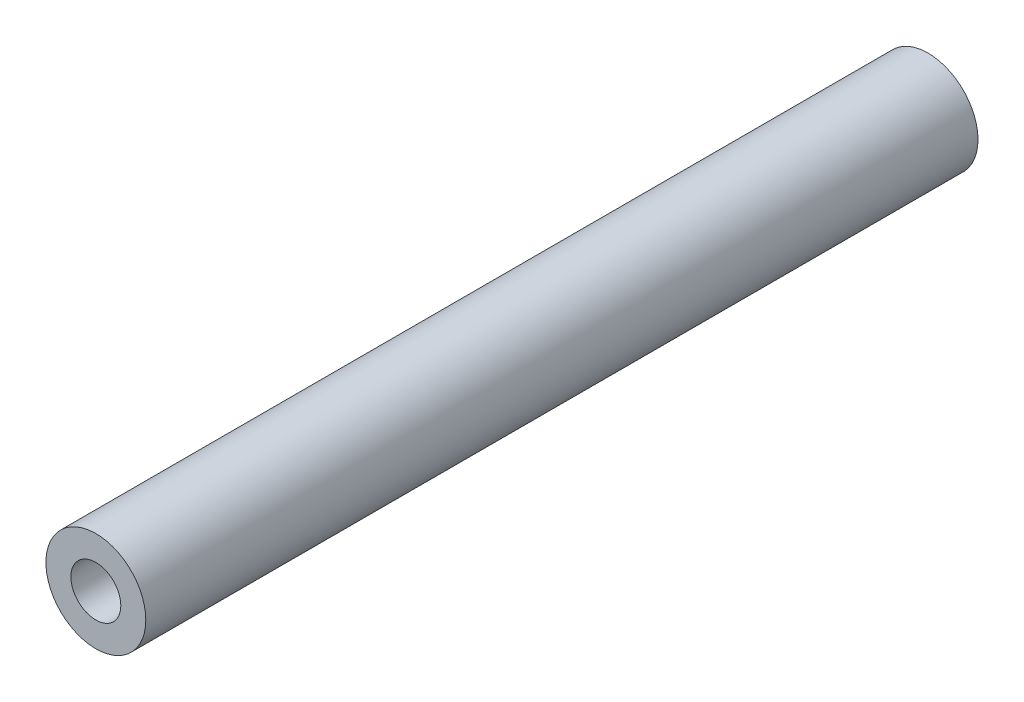
ISO-10303-21;
HEADER;
FILE_DESCRIPTION(('STEP AP214'),'2;1');
FILE_NAME('part.step','',(''),(''),'','','');
FILE_SCHEMA(('AUTOMOTIVE_DESIGN { 1 0 10303 214 1 1 1 1 }'));
ENDSEC;
DATA;
#1=APPLICATION_CONTEXT('core data for automotive mechanical design processes');
#2=APPLICATION_PROTOCOL_DEFINITION('international standard','automotive_design',2000,#1);
#3=PRODUCT_CONTEXT('',#1,'mechanical');
#4=PRODUCT('Part','Part','',(#3));
#5=PRODUCT_RELATED_PRODUCT_CATEGORY('part','',(#4));
#6=PRODUCT_DEFINITION_FORMATION('','',#4);
#7=PRODUCT_DEFINITION_CONTEXT('part definition',#1,'design');
#8=PRODUCT_DEFINITION('design','',#6,#7);
#9=PRODUCT_DEFINITION_SHAPE('','',#8);
#10=(LENGTH_UNIT() NAMED_UNIT(*) SI_UNIT(.MILLI.,.METRE.));
#11=(NAMED_UNIT(*) PLANE_ANGLE_UNIT() SI_UNIT($,.RADIAN.));
#12=(NAMED_UNIT(*) SI_UNIT($,.STERADIAN.) SOLID_ANGLE_UNIT());
#13=UNCERTAINTY_MEASURE_WITH_UNIT(LENGTH_MEASURE(1.E-05),#10,'distance_accuracy_value','');
#14=(GEOMETRIC_REPRESENTATION_CONTEXT(3) GLOBAL_UNCERTAINTY_ASSIGNED_CONTEXT((#13)) GLOBAL_UNIT_ASSIGNED_CONTEXT((#10,
#11,#12)) REPRESENTATION_CONTEXT('',''));
#15=CARTESIAN_POINT('',(0.,0.,0.));
#16=DIRECTION('',(0.,0.,1.));
#17=DIRECTION('',(1.,0.,0.));
#18=AXIS2_PLACEMENT_3D('',#15,#16,#17);
#19=CARTESIAN_POINT('',(-223.055584671765,347.748467450365,500.));
#20=DIRECTION('',(0.,0.,1.));
#21=DIRECTION('',(1.,0.,0.));
#22=AXIS2_PLACEMENT_3D('',#19,#20,#21);
#23=PLANE('',#22);
#24=CARTESIAN_POINT('',(-223.055584671765,347.748467450365,500.));
#25=DIRECTION('',(0.,0.,1.));
#26=DIRECTION('',(1.,0.,0.));
#27=AXIS2_PLACEMENT_3D('',#24,#25,#26);
#28=CIRCLE('',#27,30.);
#29=CARTESIAN_POINT('',(-193.055584671765,347.748467450365,500.));
#30=VERTEX_POINT('',#29);
#31=EDGE_CURVE('E10',#30,#30,#28,.T.);
#32=ORIENTED_EDGE('',*,*,#31,.T.);
#33=EDGE_LOOP('',(#32));
#34=FACE_BOUND('',#33,.T.);
#35=CARTESIAN_POINT('',(-223.055584671765,347.748467450365,500.));
#36=DIRECTION('',(0.,0.,1.));
#37=DIRECTION('',(1.,0.,0.));
#38=AXIS2_PLACEMENT_3D('',#35,#36,#37);
#39=CIRCLE('',#38,15.);
#40=CARTESIAN_POINT('',(-208.055584671765,347.748467450365,500.));
#41=VERTEX_POINT('',#40);
#42=EDGE_CURVE('E46',#41,#41,#39,.T.);
#43=ORIENTED_EDGE('',*,*,#42,.F.);
#44=EDGE_LOOP('',(#43));
#45=FACE_BOUND('',#44,.T.);
#46=ADVANCED_FACE('F35',(#34,#45),#23,.T.);
#47=CARTESIAN_POINT('',(-223.055584671765,347.748467450365,0.));
#48=DIRECTION('',(0.,0.,1.));
#49=DIRECTION('',(1.,0.,0.));
#50=AXIS2_PLACEMENT_3D('',#47,#48,#49);
#51=PLANE('',#50);
#52=CARTESIAN_POINT('',(-223.055584671765,347.748467450365,0.));
#53=DIRECTION('',(0.,0.,1.));
#54=DIRECTION('',(1.,0.,0.));
#55=AXIS2_PLACEMENT_3D('',#52,#53,#54);
#56=CIRCLE('',#55,30.);
#57=CARTESIAN_POINT('',(-193.055584671765,347.748467450365,0.));
#58=VERTEX_POINT('',#57);
#59=EDGE_CURVE('E39',#58,#58,#56,.T.);
#60=ORIENTED_EDGE('',*,*,#59,.F.);
#61=EDGE_LOOP('',(#60));
#62=FACE_BOUND('',#61,.T.);
#63=CARTESIAN_POINT('',(-223.055584671765,347.748467450365,0.));
#64=DIRECTION('',(0.,0.,1.));
#65=DIRECTION('',(1.,0.,0.));
#66=AXIS2_PLACEMENT_3D('',#63,#64,#65);
#67=CIRCLE('',#66,15.);
#68=CARTESIAN_POINT('',(-208.055584671765,347.748467450365,0.));
#69=VERTEX_POINT('',#68);
#70=EDGE_CURVE('E48',#69,#69,#67,.T.);
#71=ORIENTED_EDGE('',*,*,#70,.T.);
#72=EDGE_LOOP('',(#71));
#73=FACE_BOUND('',#72,.T.);
#74=ADVANCED_FACE('F58',(#62,#73),#51,.F.);
#75=CARTESIAN_POINT('',(-223.055584671765,347.748467450365,500.));
#76=DIRECTION('',(0.,0.,-1.));
#77=DIRECTION('',(-1.,0.,0.));
#78=AXIS2_PLACEMENT_3D('',#75,#76,#77);
#79=CYLINDRICAL_SURFACE('',#78,30.);
#80=ORIENTED_EDGE('',*,*,#31,.F.);
#81=EDGE_LOOP('',(#80));
#82=FACE_BOUND('',#81,.T.);
#83=ORIENTED_EDGE('',*,*,#59,.T.);
#84=EDGE_LOOP('',(#83));
#85=FACE_BOUND('',#84,.T.);
#86=ADVANCED_FACE('F37',(#82,#85),#79,.T.);
#87=CARTESIAN_POINT('',(-223.055584671765,347.748467450365,500.));
#88=DIRECTION('',(0.,0.,-1.));
#89=DIRECTION('',(-1.,0.,0.));
#90=AXIS2_PLACEMENT_3D('',#87,#88,#89);
#91=CYLINDRICAL_SURFACE('',#90,15.);
#92=ORIENTED_EDGE('',*,*,#42,.T.);
#93=EDGE_LOOP('',(#92));
#94=FACE_BOUND('',#93,.T.);
#95=ORIENTED_EDGE('',*,*,#70,.F.);
#96=EDGE_LOOP('',(#95));
#97=FACE_BOUND('',#96,.T.);
#98=ADVANCED_FACE('F54',(#94,#97),#91,.F.);
#99=CLOSED_SHELL('',(#46,#74,#86,#98));
#100=MANIFOLD_SOLID_BREP('B2',#99);
#101=ADVANCED_BREP_SHAPE_REPRESENTATION('',(#18,#100),#14);
#102=SHAPE_DEFINITION_REPRESENTATION(#9,#101);
ENDSEC;
END-ISO-10303-21;
